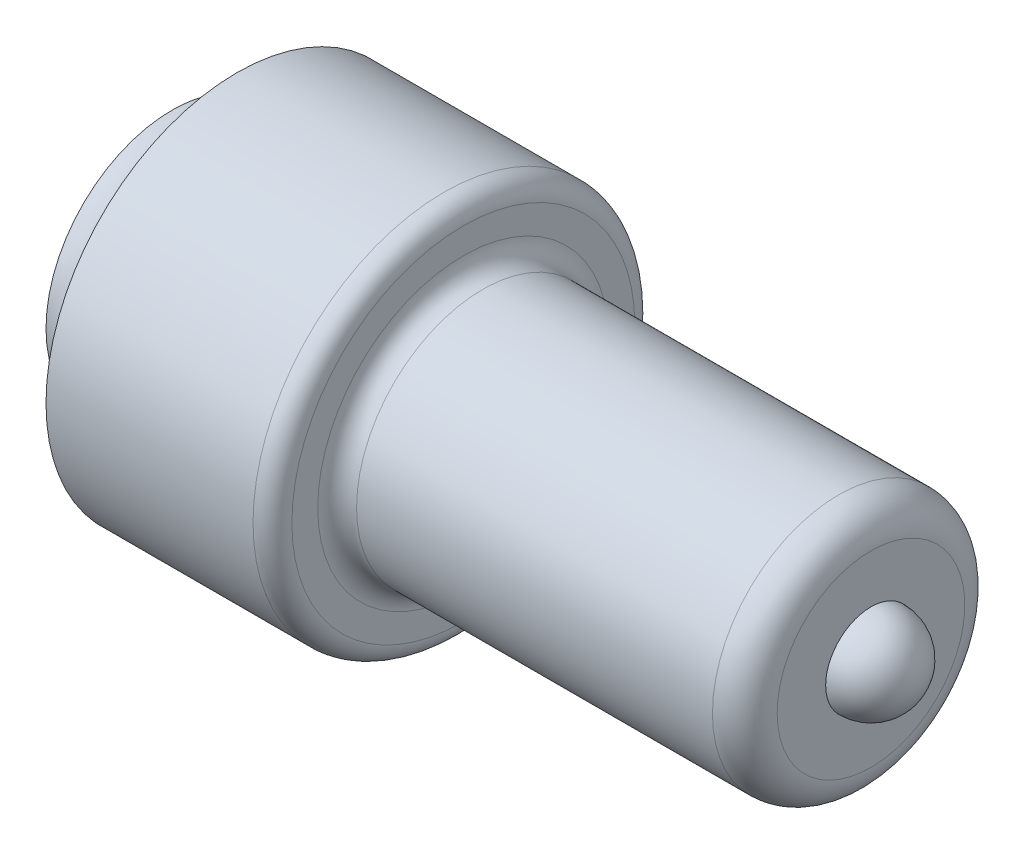
ISO-10303-21;
HEADER;
FILE_DESCRIPTION(('STEP AP214'),'2;1');
FILE_NAME('part.step','',(''),(''),'','','');
FILE_SCHEMA(('AUTOMOTIVE_DESIGN { 1 0 10303 214 1 1 1 1 }'));
ENDSEC;
DATA;
#1=APPLICATION_CONTEXT('core data for automotive mechanical design processes');
#2=APPLICATION_PROTOCOL_DEFINITION('international standard','automotive_design',2000,#1);
#3=PRODUCT_CONTEXT('',#1,'mechanical');
#4=PRODUCT('Part','Part','',(#3));
#5=PRODUCT_RELATED_PRODUCT_CATEGORY('part','',(#4));
#6=PRODUCT_DEFINITION_FORMATION('','',#4);
#7=PRODUCT_DEFINITION_CONTEXT('part definition',#1,'design');
#8=PRODUCT_DEFINITION('design','',#6,#7);
#9=PRODUCT_DEFINITION_SHAPE('','',#8);
#10=(LENGTH_UNIT() NAMED_UNIT(*) SI_UNIT(.MILLI.,.METRE.));
#11=(NAMED_UNIT(*) PLANE_ANGLE_UNIT() SI_UNIT($,.RADIAN.));
#12=(NAMED_UNIT(*) SI_UNIT($,.STERADIAN.) SOLID_ANGLE_UNIT());
#13=UNCERTAINTY_MEASURE_WITH_UNIT(LENGTH_MEASURE(1.E-05),#10,'distance_accuracy_value','');
#14=(GEOMETRIC_REPRESENTATION_CONTEXT(3) GLOBAL_UNCERTAINTY_ASSIGNED_CONTEXT((#13)) GLOBAL_UNIT_ASSIGNED_CONTEXT((#10,
#11,#12)) REPRESENTATION_CONTEXT('',''));
#15=CARTESIAN_POINT('',(0.,0.,0.));
#16=DIRECTION('',(0.,0.,1.));
#17=DIRECTION('',(1.,0.,0.));
#18=AXIS2_PLACEMENT_3D('',#15,#16,#17);
#19=CARTESIAN_POINT('',(0.,0.,0.));
#20=DIRECTION('',(1.,0.,0.));
#21=DIRECTION('',(0.,0.,-1.));
#22=AXIS2_PLACEMENT_3D('',#19,#20,#21);
#23=PLANE('',#22);
#24=CARTESIAN_POINT('',(0.,0.,0.));
#25=DIRECTION('',(-1.,0.,0.));
#26=DIRECTION('',(0.,0.,1.));
#27=AXIS2_PLACEMENT_3D('',#24,#25,#26);
#28=CIRCLE('',#27,24.765);
#29=CARTESIAN_POINT('',(0.,0.,24.765));
#30=VERTEX_POINT('',#29);
#31=EDGE_CURVE('E62',#30,#30,#28,.T.);
#32=ORIENTED_EDGE('',*,*,#31,.T.);
#33=EDGE_LOOP('',(#32));
#34=FACE_BOUND('',#33,.T.);
#35=ADVANCED_FACE('F31',(#34),#23,.F.);
#36=CARTESIAN_POINT('',(137.16,0.,0.));
#37=DIRECTION('',(-1.,0.,0.));
#38=DIRECTION('',(0.,1.,0.));
#39=AXIS2_PLACEMENT_3D('',#36,#37,#38);
#40=SPHERICAL_SURFACE('',#39,8.89);
#41=CARTESIAN_POINT('',(137.16,0.,0.));
#42=DIRECTION('',(-1.,0.,0.));
#43=DIRECTION('',(0.,0.,1.));
#44=AXIS2_PLACEMENT_3D('',#41,#42,#43);
#45=CIRCLE('',#44,8.89);
#46=CARTESIAN_POINT('',(137.16,0.,8.89));
#47=VERTEX_POINT('',#46);
#48=EDGE_CURVE('E10',#47,#47,#45,.T.);
#49=ORIENTED_EDGE('',*,*,#48,.F.);
#50=EDGE_LOOP('',(#49));
#51=FACE_BOUND('',#50,.T.);
#52=ADVANCED_FACE('F110',(#51),#40,.T.);
#53=CARTESIAN_POINT('',(137.16,18.415,0.));
#54=DIRECTION('',(-1.,0.,0.));
#55=DIRECTION('',(0.,0.,1.));
#56=AXIS2_PLACEMENT_3D('',#53,#54,#55);
#57=PLANE('',#56);
#58=CARTESIAN_POINT('',(137.16,0.,0.));
#59=DIRECTION('',(-1.,0.,0.));
#60=DIRECTION('',(0.,0.,1.));
#61=AXIS2_PLACEMENT_3D('',#58,#59,#60);
#62=CIRCLE('',#61,18.415);
#63=CARTESIAN_POINT('',(137.16,0.,18.415));
#64=VERTEX_POINT('',#63);
#65=EDGE_CURVE('E37',#64,#64,#62,.T.);
#66=ORIENTED_EDGE('',*,*,#65,.F.);
#67=EDGE_LOOP('',(#66));
#68=FACE_BOUND('',#67,.T.);
#69=ORIENTED_EDGE('',*,*,#48,.T.);
#70=EDGE_LOOP('',(#69));
#71=FACE_BOUND('',#70,.T.);
#72=ADVANCED_FACE('F105',(#68,#71),#57,.F.);
#73=CARTESIAN_POINT('',(130.81,0.,0.));
#74=DIRECTION('',(-1.,0.,0.));
#75=DIRECTION('',(0.,0.,1.));
#76=AXIS2_PLACEMENT_3D('',#73,#74,#75);
#77=TOROIDAL_SURFACE('',#76,18.415,6.35);
#78=CARTESIAN_POINT('',(130.81,0.,0.));
#79=DIRECTION('',(-1.,0.,0.));
#80=DIRECTION('',(0.,0.,1.));
#81=AXIS2_PLACEMENT_3D('',#78,#79,#80);
#82=CIRCLE('',#81,24.765);
#83=CARTESIAN_POINT('',(130.81,0.,24.765));
#84=VERTEX_POINT('',#83);
#85=EDGE_CURVE('E41',#84,#84,#82,.T.);
#86=ORIENTED_EDGE('',*,*,#85,.F.);
#87=EDGE_LOOP('',(#86));
#88=FACE_BOUND('',#87,.T.);
#89=ORIENTED_EDGE('',*,*,#65,.T.);
#90=EDGE_LOOP('',(#89));
#91=FACE_BOUND('',#90,.T.);
#92=ADVANCED_FACE('F100',(#88,#91),#77,.T.);
#93=CARTESIAN_POINT('',(0.,0.,0.));
#94=DIRECTION('',(-1.,0.,0.));
#95=DIRECTION('',(0.,0.,1.));
#96=AXIS2_PLACEMENT_3D('',#93,#94,#95);
#97=CYLINDRICAL_SURFACE('',#96,24.765);
#98=CARTESIAN_POINT('',(60.96,0.,0.));
#99=DIRECTION('',(-1.,0.,0.));
#100=DIRECTION('',(0.,0.,1.));
#101=AXIS2_PLACEMENT_3D('',#98,#99,#100);
#102=CIRCLE('',#101,24.765);
#103=CARTESIAN_POINT('',(60.96,0.,24.765));
#104=VERTEX_POINT('',#103);
#105=EDGE_CURVE('E45',#104,#104,#102,.T.);
#106=ORIENTED_EDGE('',*,*,#105,.F.);
#107=EDGE_LOOP('',(#106));
#108=FACE_BOUND('',#107,.T.);
#109=ORIENTED_EDGE('',*,*,#85,.T.);
#110=EDGE_LOOP('',(#109));
#111=FACE_BOUND('',#110,.T.);
#112=ADVANCED_FACE('F94',(#108,#111),#97,.T.);
#113=CARTESIAN_POINT('',(60.96,0.,0.));
#114=DIRECTION('',(-1.,0.,0.));
#115=DIRECTION('',(0.,0.,1.));
#116=AXIS2_PLACEMENT_3D('',#113,#114,#115);
#117=TOROIDAL_SURFACE('',#116,28.575,3.81);
#118=CARTESIAN_POINT('',(57.15,0.,0.));
#119=DIRECTION('',(-1.,0.,0.));
#120=DIRECTION('',(0.,0.,1.));
#121=AXIS2_PLACEMENT_3D('',#118,#119,#120);
#122=CIRCLE('',#121,28.575);
#123=CARTESIAN_POINT('',(57.15,0.,28.575));
#124=VERTEX_POINT('',#123);
#125=EDGE_CURVE('E50',#124,#124,#122,.T.);
#126=ORIENTED_EDGE('',*,*,#125,.F.);
#127=EDGE_LOOP('',(#126));
#128=FACE_BOUND('',#127,.T.);
#129=ORIENTED_EDGE('',*,*,#105,.T.);
#130=EDGE_LOOP('',(#129));
#131=FACE_BOUND('',#130,.T.);
#132=ADVANCED_FACE('F88',(#128,#131),#117,.F.);
#133=CARTESIAN_POINT('',(57.15,33.655,0.));
#134=DIRECTION('',(-1.,0.,0.));
#135=DIRECTION('',(0.,0.,1.));
#136=AXIS2_PLACEMENT_3D('',#133,#134,#135);
#137=PLANE('',#136);
#138=CARTESIAN_POINT('',(57.15,0.,0.));
#139=DIRECTION('',(-1.,0.,0.));
#140=DIRECTION('',(0.,0.,1.));
#141=AXIS2_PLACEMENT_3D('',#138,#139,#140);
#142=CIRCLE('',#141,33.655);
#143=CARTESIAN_POINT('',(57.15,0.,33.655));
#144=VERTEX_POINT('',#143);
#145=EDGE_CURVE('E53',#144,#144,#142,.T.);
#146=ORIENTED_EDGE('',*,*,#145,.F.);
#147=EDGE_LOOP('',(#146));
#148=FACE_BOUND('',#147,.T.);
#149=ORIENTED_EDGE('',*,*,#125,.T.);
#150=EDGE_LOOP('',(#149));
#151=FACE_BOUND('',#150,.T.);
#152=ADVANCED_FACE('F82',(#148,#151),#137,.F.);
#153=CARTESIAN_POINT('',(53.34,0.,0.));
#154=DIRECTION('',(-1.,0.,0.));
#155=DIRECTION('',(0.,0.,1.));
#156=AXIS2_PLACEMENT_3D('',#153,#154,#155);
#157=TOROIDAL_SURFACE('',#156,33.655,3.81);
#158=CARTESIAN_POINT('',(53.34,0.,0.));
#159=DIRECTION('',(-1.,0.,0.));
#160=DIRECTION('',(0.,0.,1.));
#161=AXIS2_PLACEMENT_3D('',#158,#159,#160);
#162=CIRCLE('',#161,37.465);
#163=CARTESIAN_POINT('',(53.34,0.,37.465));
#164=VERTEX_POINT('',#163);
#165=EDGE_CURVE('E56',#164,#164,#162,.T.);
#166=ORIENTED_EDGE('',*,*,#165,.F.);
#167=EDGE_LOOP('',(#166));
#168=FACE_BOUND('',#167,.T.);
#169=ORIENTED_EDGE('',*,*,#145,.T.);
#170=EDGE_LOOP('',(#169));
#171=FACE_BOUND('',#170,.T.);
#172=ADVANCED_FACE('F76',(#168,#171),#157,.T.);
#173=CARTESIAN_POINT('',(0.,0.,0.));
#174=DIRECTION('',(-1.,0.,0.));
#175=DIRECTION('',(0.,0.,1.));
#176=AXIS2_PLACEMENT_3D('',#173,#174,#175);
#177=CYLINDRICAL_SURFACE('',#176,37.465);
#178=CARTESIAN_POINT('',(12.7,0.,0.));
#179=DIRECTION('',(-1.,0.,0.));
#180=DIRECTION('',(0.,0.,1.));
#181=AXIS2_PLACEMENT_3D('',#178,#179,#180);
#182=CIRCLE('',#181,37.465);
#183=CARTESIAN_POINT('',(12.7,0.,37.465));
#184=VERTEX_POINT('',#183);
#185=EDGE_CURVE('E59',#184,#184,#182,.T.);
#186=ORIENTED_EDGE('',*,*,#185,.F.);
#187=EDGE_LOOP('',(#186));
#188=FACE_BOUND('',#187,.T.);
#189=ORIENTED_EDGE('',*,*,#165,.T.);
#190=EDGE_LOOP('',(#189));
#191=FACE_BOUND('',#190,.T.);
#192=ADVANCED_FACE('F70',(#188,#191),#177,.T.);
#193=CARTESIAN_POINT('',(0.,0.,0.));
#194=DIRECTION('',(-1.,0.,0.));
#195=DIRECTION('',(0.,0.,1.));
#196=AXIS2_PLACEMENT_3D('',#193,#194,#195);
#197=TOROIDAL_SURFACE('',#196,37.465,12.7);
#198=ORIENTED_EDGE('',*,*,#31,.F.);
#199=EDGE_LOOP('',(#198));
#200=FACE_BOUND('',#199,.T.);
#201=ORIENTED_EDGE('',*,*,#185,.T.);
#202=EDGE_LOOP('',(#201));
#203=FACE_BOUND('',#202,.T.);
#204=ADVANCED_FACE('F67',(#200,#203),#197,.F.);
#205=CLOSED_SHELL('',(#35,#52,#72,#92,#112,#132,#152,#172,#192,#204));
#206=MANIFOLD_SOLID_BREP('B2',#205);
#207=ADVANCED_BREP_SHAPE_REPRESENTATION('',(#18,#206),#14);
#208=SHAPE_DEFINITION_REPRESENTATION(#9,#207);
ENDSEC;
END-ISO-10303-21;
